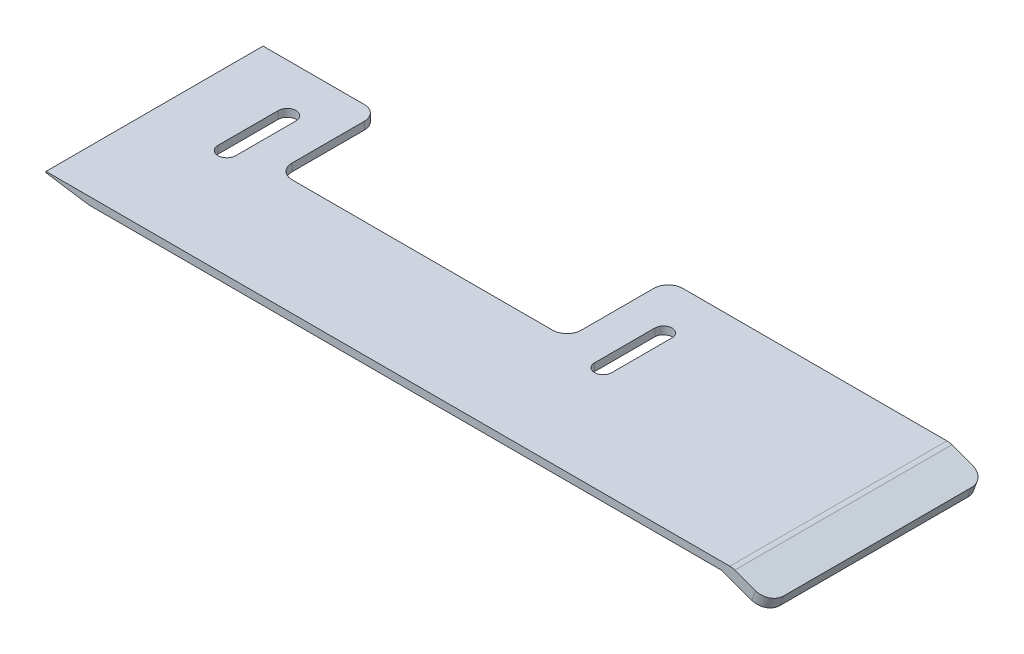
ISO-10303-21;
HEADER;
FILE_DESCRIPTION(('STEP AP214'),'2;1');
FILE_NAME('part.step','',(''),(''),'','','');
FILE_SCHEMA(('AUTOMOTIVE_DESIGN { 1 0 10303 214 1 1 1 1 }'));
ENDSEC;
DATA;
#1=APPLICATION_CONTEXT('core data for automotive mechanical design processes');
#2=APPLICATION_PROTOCOL_DEFINITION('international standard','automotive_design',2000,#1);
#3=PRODUCT_CONTEXT('',#1,'mechanical');
#4=PRODUCT('Part','Part','',(#3));
#5=PRODUCT_RELATED_PRODUCT_CATEGORY('part','',(#4));
#6=PRODUCT_DEFINITION_FORMATION('','',#4);
#7=PRODUCT_DEFINITION_CONTEXT('part definition',#1,'design');
#8=PRODUCT_DEFINITION('design','',#6,#7);
#9=PRODUCT_DEFINITION_SHAPE('','',#8);
#10=(LENGTH_UNIT() NAMED_UNIT(*) SI_UNIT(.MILLI.,.METRE.));
#11=(NAMED_UNIT(*) PLANE_ANGLE_UNIT() SI_UNIT($,.RADIAN.));
#12=(NAMED_UNIT(*) SI_UNIT($,.STERADIAN.) SOLID_ANGLE_UNIT());
#13=UNCERTAINTY_MEASURE_WITH_UNIT(LENGTH_MEASURE(1.E-05),#10,'distance_accuracy_value','');
#14=(GEOMETRIC_REPRESENTATION_CONTEXT(3) GLOBAL_UNCERTAINTY_ASSIGNED_CONTEXT((#13)) GLOBAL_UNIT_ASSIGNED_CONTEXT((#10,
#11,#12)) REPRESENTATION_CONTEXT('',''));
#15=CARTESIAN_POINT('',(0.,0.,0.));
#16=DIRECTION('',(0.,0.,1.));
#17=DIRECTION('',(1.,0.,0.));
#18=AXIS2_PLACEMENT_3D('',#15,#16,#17);
#19=CARTESIAN_POINT('',(0.,0.,0.));
#20=DIRECTION('',(0.,0.,-1.));
#21=DIRECTION('',(-1.,0.,0.));
#22=AXIS2_PLACEMENT_3D('',#19,#20,#21);
#23=PLANE('',#22);
#24=DIRECTION('',(1.,0.,0.));
#25=VECTOR('',#24,1.);
#26=CARTESIAN_POINT('',(22.4676053463481,5.16084952604156,0.));
#27=LINE('',#26,#25);
#28=CARTESIAN_POINT('',(-12.9220106473936,5.16084952604156,0.));
#29=VERTEX_POINT('',#28);
#30=CARTESIAN_POINT('',(22.4676053463481,5.16084952604156,0.));
#31=VERTEX_POINT('',#30);
#32=EDGE_CURVE('E294',#29,#31,#27,.T.);
#33=ORIENTED_EDGE('',*,*,#32,.F.);
#34=DIRECTION('',(0.,-1.,0.));
#35=VECTOR('',#34,1.);
#36=CARTESIAN_POINT('',(-12.9220106473936,6.21881141029235,0.));
#37=LINE('',#36,#35);
#38=CARTESIAN_POINT('',(-12.9220106473936,6.21881141029235,0.));
#39=VERTEX_POINT('',#38);
#40=EDGE_CURVE('E395',#29,#39,#37,.F.);
#41=ORIENTED_EDGE('',*,*,#40,.T.);
#42=DIRECTION('',(-1.,0.,0.));
#43=VECTOR('',#42,1.);
#44=CARTESIAN_POINT('',(-70.9220106473936,6.21881141029235,0.));
#45=LINE('',#44,#43);
#46=CARTESIAN_POINT('',(23.5939315975531,6.21881141029235,0.));
#47=VERTEX_POINT('',#46);
#48=EDGE_CURVE('E277',#47,#39,#45,.T.);
#49=ORIENTED_EDGE('',*,*,#48,.F.);
#50=CARTESIAN_POINT('',(23.5939315975531,4.21881141029235,0.));
#51=DIRECTION('',(0.,0.,-1.));
#52=DIRECTION('',(-1.,0.,0.));
#53=AXIS2_PLACEMENT_3D('',#50,#51,#52);
#54=CIRCLE('',#53,2.);
#55=CARTESIAN_POINT('',(24.2779718842045,6.09819665186416,0.));
#56=VERTEX_POINT('',#55);
#57=EDGE_CURVE('E345',#47,#56,#54,.T.);
#58=ORIENTED_EDGE('',*,*,#57,.T.);
#59=DIRECTION('',(-0.939692620785908,0.342020143325669,0.));
#60=VECTOR('',#59,1.);
#61=CARTESIAN_POINT('',(23.9465855589701,6.21881141029235,0.));
#62=LINE('',#61,#60);
#63=CARTESIAN_POINT('',(27.1415404696422,5.05594292298507,0.));
#64=VERTEX_POINT('',#63);
#65=EDGE_CURVE('E301',#64,#56,#62,.T.);
#66=ORIENTED_EDGE('',*,*,#65,.F.);
#67=DIRECTION('',(0.342020143325671,0.939692620785908,0.));
#68=VECTOR('',#67,1.);
#69=CARTESIAN_POINT('',(26.6285102546536,3.64640399180621,0.));
#70=LINE('',#69,#68);
#71=CARTESIAN_POINT('',(26.6285102546536,3.64640399180621,0.));
#72=VERTEX_POINT('',#71);
#73=EDGE_CURVE('E340',#64,#72,#70,.F.);
#74=ORIENTED_EDGE('',*,*,#73,.T.);
#75=DIRECTION('',(0.939692620785908,-0.34202014332567,0.));
#76=VECTOR('',#75,1.);
#77=CARTESIAN_POINT('',(28.5078954962255,2.96236370515487,0.));
#78=LINE('',#77,#76);
#79=EDGE_CURVE('E298',#31,#72,#78,.T.);
#80=ORIENTED_EDGE('',*,*,#79,.F.);
#81=EDGE_LOOP('',(#33,#41,#49,#58,#66,#74,#80));
#82=FACE_BOUND('',#81,.T.);
#83=ADVANCED_FACE('F32',(#82),#23,.T.);
#84=CARTESIAN_POINT('',(-70.9220106473936,6.06099027058349,30.));
#85=DIRECTION('',(1.,0.,0.));
#86=DIRECTION('',(0.,0.,-1.));
#87=AXIS2_PLACEMENT_3D('',#84,#85,#86);
#88=PLANE('',#87);
#89=DIRECTION('',(0.,-1.,0.));
#90=VECTOR('',#89,1.);
#91=CARTESIAN_POINT('',(-70.9220106473936,6.06099027058349,0.));
#92=LINE('',#91,#90);
#93=CARTESIAN_POINT('',(-70.9220106473936,6.21881141029235,0.));
#94=VERTEX_POINT('',#93);
#95=CARTESIAN_POINT('',(-70.9220106473936,6.06099027058349,0.));
#96=VERTEX_POINT('',#95);
#97=EDGE_CURVE('E272',#94,#96,#92,.T.);
#98=ORIENTED_EDGE('',*,*,#97,.T.);
#99=DIRECTION('',(0.,0.,-1.));
#100=VECTOR('',#99,1.);
#101=CARTESIAN_POINT('',(-70.9220106473936,6.06099027058349,30.));
#102=LINE('',#101,#100);
#103=CARTESIAN_POINT('',(-70.9220106473936,6.06099027058349,30.));
#104=VERTEX_POINT('',#103);
#105=EDGE_CURVE('E321',#104,#96,#102,.T.);
#106=ORIENTED_EDGE('',*,*,#105,.F.);
#107=DIRECTION('',(0.,-1.,0.));
#108=VECTOR('',#107,1.);
#109=CARTESIAN_POINT('',(-70.9220106473936,6.06099027058349,30.));
#110=LINE('',#109,#108);
#111=CARTESIAN_POINT('',(-70.9220106473936,6.21881141029235,30.));
#112=VERTEX_POINT('',#111);
#113=EDGE_CURVE('E273',#112,#104,#110,.T.);
#114=ORIENTED_EDGE('',*,*,#113,.F.);
#115=DIRECTION('',(0.,0.,-1.));
#116=VECTOR('',#115,1.);
#117=CARTESIAN_POINT('',(-70.9220106473936,6.21881141029235,30.));
#118=LINE('',#117,#116);
#119=EDGE_CURVE('E289',#112,#94,#118,.T.);
#120=ORIENTED_EDGE('',*,*,#119,.T.);
#121=EDGE_LOOP('',(#98,#106,#114,#120));
#122=FACE_BOUND('',#121,.T.);
#123=ADVANCED_FACE('F431',(#122),#88,.F.);
#124=CARTESIAN_POINT('',(-64.9220106473936,5.16084952604155,30.));
#125=DIRECTION('',(0.148363140244914,0.988932949505005,0.));
#126=DIRECTION('',(-0.988932949505005,0.148363140244914,0.));
#127=AXIS2_PLACEMENT_3D('',#124,#125,#126);
#128=PLANE('',#127);
#129=DIRECTION('',(0.988932949505005,-0.148363140244914,0.));
#130=VECTOR('',#129,1.);
#131=CARTESIAN_POINT('',(-64.9220106473936,5.16084952604155,0.));
#132=LINE('',#131,#130);
#133=CARTESIAN_POINT('',(-64.9220106473936,5.16084952604155,0.));
#134=VERTEX_POINT('',#133);
#135=EDGE_CURVE('E292',#96,#134,#132,.T.);
#136=ORIENTED_EDGE('',*,*,#135,.T.);
#137=DIRECTION('',(0.,0.,-1.));
#138=VECTOR('',#137,1.);
#139=CARTESIAN_POINT('',(-64.9220106473936,5.16084952604155,30.));
#140=LINE('',#139,#138);
#141=CARTESIAN_POINT('',(-64.9220106473936,5.16084952604155,30.));
#142=VERTEX_POINT('',#141);
#143=EDGE_CURVE('E318',#142,#134,#140,.T.);
#144=ORIENTED_EDGE('',*,*,#143,.F.);
#145=DIRECTION('',(0.988932949505005,-0.148363140244914,0.));
#146=VECTOR('',#145,1.);
#147=CARTESIAN_POINT('',(-64.9220106473936,5.16084952604155,30.));
#148=LINE('',#147,#146);
#149=EDGE_CURVE('E276',#104,#142,#148,.T.);
#150=ORIENTED_EDGE('',*,*,#149,.F.);
#151=ORIENTED_EDGE('',*,*,#105,.T.);
#152=EDGE_LOOP('',(#136,#144,#150,#151));
#153=FACE_BOUND('',#152,.T.);
#154=ADVANCED_FACE('F490',(#153),#128,.F.);
#155=CARTESIAN_POINT('',(22.4676053463481,5.16084952604156,30.));
#156=DIRECTION('',(0.,1.,0.));
#157=DIRECTION('',(-1.,0.,0.));
#158=AXIS2_PLACEMENT_3D('',#155,#156,#157);
#159=PLANE('',#158);
#160=DIRECTION('',(0.,0.,1.));
#161=VECTOR('',#160,1.);
#162=CARTESIAN_POINT('',(-59.6885627096651,5.16084952604156,6.67422642033291));
#163=LINE('',#162,#161);
#164=CARTESIAN_POINT('',(-59.6885627096651,5.16084952604156,6.67422642033291));
#165=VERTEX_POINT('',#164);
#166=CARTESIAN_POINT('',(-59.6885627096651,5.16084952604156,15.));
#167=VERTEX_POINT('',#166);
#168=EDGE_CURVE('E219',#165,#167,#163,.T.);
#169=ORIENTED_EDGE('',*,*,#168,.F.);
#170=CARTESIAN_POINT('',(-60.9220106473936,5.16084952604156,6.67422642033291));
#171=DIRECTION('',(0.,-1.,0.));
#172=DIRECTION('',(1.,0.,0.));
#173=AXIS2_PLACEMENT_3D('',#170,#171,#172);
#174=CIRCLE('',#173,1.23344793772846);
#175=CARTESIAN_POINT('',(-62.155458585122,5.16084952604155,6.67422642033291));
#176=VERTEX_POINT('',#175);
#177=EDGE_CURVE('E224',#176,#165,#174,.T.);
#178=ORIENTED_EDGE('',*,*,#177,.F.);
#179=DIRECTION('',(0.,0.,-1.));
#180=VECTOR('',#179,1.);
#181=CARTESIAN_POINT('',(-62.155458585122,5.16084952604155,6.67422642033291));
#182=LINE('',#181,#180);
#183=CARTESIAN_POINT('',(-62.155458585122,5.16084952604156,15.));
#184=VERTEX_POINT('',#183);
#185=EDGE_CURVE('E229',#184,#176,#182,.T.);
#186=ORIENTED_EDGE('',*,*,#185,.F.);
#187=CARTESIAN_POINT('',(-60.9220106473936,5.16084952604156,15.));
#188=DIRECTION('',(0.,-1.,0.));
#189=DIRECTION('',(1.,0.,0.));
#190=AXIS2_PLACEMENT_3D('',#187,#188,#189);
#191=CIRCLE('',#190,1.23344793772846);
#192=EDGE_CURVE('E208',#167,#184,#191,.T.);
#193=ORIENTED_EDGE('',*,*,#192,.F.);
#194=EDGE_LOOP('',(#169,#178,#186,#193));
#195=FACE_BOUND('',#194,.T.);
#196=DIRECTION('',(0.,0.,1.));
#197=VECTOR('',#196,1.);
#198=CARTESIAN_POINT('',(-7.73995637373712,5.16084952604156,6.6742264203329));
#199=LINE('',#198,#197);
#200=CARTESIAN_POINT('',(-7.73995637373713,5.16084952604156,6.67422642033291));
#201=VERTEX_POINT('',#200);
#202=CARTESIAN_POINT('',(-7.73995637373713,5.16084952604156,15.));
#203=VERTEX_POINT('',#202);
#204=EDGE_CURVE('E241',#201,#203,#199,.T.);
#205=ORIENTED_EDGE('',*,*,#204,.F.);
#206=CARTESIAN_POINT('',(-8.92201064739356,5.16084952604156,6.6742264203329));
#207=DIRECTION('',(0.,-1.,0.));
#208=DIRECTION('',(1.,0.,0.));
#209=AXIS2_PLACEMENT_3D('',#206,#207,#208);
#210=CIRCLE('',#209,1.18205427365644);
#211=CARTESIAN_POINT('',(-10.10406492105,5.16084952604156,6.6742264203329));
#212=VERTEX_POINT('',#211);
#213=EDGE_CURVE('E239',#212,#201,#210,.T.);
#214=ORIENTED_EDGE('',*,*,#213,.F.);
#215=DIRECTION('',(0.,0.,-1.));
#216=VECTOR('',#215,1.);
#217=CARTESIAN_POINT('',(-10.10406492105,5.16084952604156,6.6742264203329));
#218=LINE('',#217,#216);
#219=CARTESIAN_POINT('',(-10.10406492105,5.16084952604156,15.));
#220=VERTEX_POINT('',#219);
#221=EDGE_CURVE('E247',#220,#212,#218,.T.);
#222=ORIENTED_EDGE('',*,*,#221,.F.);
#223=CARTESIAN_POINT('',(-8.92201064739357,5.16084952604156,15.));
#224=DIRECTION('',(0.,-1.,0.));
#225=DIRECTION('',(1.,0.,0.));
#226=AXIS2_PLACEMENT_3D('',#223,#224,#225);
#227=CIRCLE('',#226,1.18205427365644);
#228=EDGE_CURVE('E244',#203,#220,#227,.T.);
#229=ORIENTED_EDGE('',*,*,#228,.F.);
#230=EDGE_LOOP('',(#205,#214,#222,#229));
#231=FACE_BOUND('',#230,.T.);
#232=CARTESIAN_POINT('',(-56.9220106473936,5.16084952604156,0.));
#233=VERTEX_POINT('',#232);
#234=EDGE_CURVE('E295',#134,#233,#27,.T.);
#235=ORIENTED_EDGE('',*,*,#234,.T.);
#236=CARTESIAN_POINT('',(-56.9220106473936,5.16084952604156,2.));
#237=DIRECTION('',(0.,1.,0.));
#238=DIRECTION('',(-1.,0.,0.));
#239=AXIS2_PLACEMENT_3D('',#236,#237,#238);
#240=CIRCLE('',#239,2.);
#241=CARTESIAN_POINT('',(-54.9220106473936,5.16084952604156,2.));
#242=VERTEX_POINT('',#241);
#243=EDGE_CURVE('E388',#233,#242,#240,.F.);
#244=ORIENTED_EDGE('',*,*,#243,.T.);
#245=DIRECTION('',(0.,0.,-1.));
#246=VECTOR('',#245,1.);
#247=CARTESIAN_POINT('',(-54.9220106473936,5.16084952604156,-2.42245212041448));
#248=LINE('',#247,#246);
#249=CARTESIAN_POINT('',(-54.9220106473936,5.16084952604156,12.));
#250=VERTEX_POINT('',#249);
#251=EDGE_CURVE('E263',#250,#242,#248,.T.);
#252=ORIENTED_EDGE('',*,*,#251,.F.);
#253=CARTESIAN_POINT('',(-52.9220106473936,5.16084952604156,12.));
#254=DIRECTION('',(0.,1.,0.));
#255=DIRECTION('',(-1.,0.,0.));
#256=AXIS2_PLACEMENT_3D('',#253,#254,#255);
#257=CIRCLE('',#256,2.);
#258=CARTESIAN_POINT('',(-52.9220106473936,5.16084952604156,14.));
#259=VERTEX_POINT('',#258);
#260=EDGE_CURVE('E40',#250,#259,#257,.T.);
#261=ORIENTED_EDGE('',*,*,#260,.T.);
#262=DIRECTION('',(-1.,0.,0.));
#263=VECTOR('',#262,1.);
#264=CARTESIAN_POINT('',(-14.9220106473936,5.16084952604156,14.));
#265=LINE('',#264,#263);
#266=CARTESIAN_POINT('',(-16.9220106473936,5.16084952604156,14.));
#267=VERTEX_POINT('',#266);
#268=EDGE_CURVE('E260',#267,#259,#265,.T.);
#269=ORIENTED_EDGE('',*,*,#268,.F.);
#270=CARTESIAN_POINT('',(-16.9220106473936,5.16084952604156,12.));
#271=DIRECTION('',(0.,1.,0.));
#272=DIRECTION('',(-1.,0.,0.));
#273=AXIS2_PLACEMENT_3D('',#270,#271,#272);
#274=CIRCLE('',#273,2.);
#275=CARTESIAN_POINT('',(-14.9220106473936,5.16084952604156,12.));
#276=VERTEX_POINT('',#275);
#277=EDGE_CURVE('E53',#267,#276,#274,.T.);
#278=ORIENTED_EDGE('',*,*,#277,.T.);
#279=DIRECTION('',(0.,0.,1.));
#280=VECTOR('',#279,1.);
#281=CARTESIAN_POINT('',(-14.9220106473936,5.16084952604156,-2.42245212041447));
#282=LINE('',#281,#280);
#283=CARTESIAN_POINT('',(-14.9220106473936,5.16084952604156,2.));
#284=VERTEX_POINT('',#283);
#285=EDGE_CURVE('E236',#284,#276,#282,.T.);
#286=ORIENTED_EDGE('',*,*,#285,.F.);
#287=CARTESIAN_POINT('',(-12.9220106473936,5.16084952604156,2.));
#288=DIRECTION('',(0.,1.,0.));
#289=DIRECTION('',(-1.,0.,0.));
#290=AXIS2_PLACEMENT_3D('',#287,#288,#289);
#291=CIRCLE('',#290,2.);
#292=EDGE_CURVE('E47',#284,#29,#291,.F.);
#293=ORIENTED_EDGE('',*,*,#292,.T.);
#294=ORIENTED_EDGE('',*,*,#32,.T.);
#295=DIRECTION('',(0.,0.,-1.));
#296=VECTOR('',#295,1.);
#297=CARTESIAN_POINT('',(22.4676053463481,5.16084952604156,30.));
#298=LINE('',#297,#296);
#299=CARTESIAN_POINT('',(22.4676053463481,5.16084952604156,30.));
#300=VERTEX_POINT('',#299);
#301=EDGE_CURVE('E315',#300,#31,#298,.T.);
#302=ORIENTED_EDGE('',*,*,#301,.F.);
#303=DIRECTION('',(1.,0.,0.));
#304=VECTOR('',#303,1.);
#305=CARTESIAN_POINT('',(22.4676053463481,5.16084952604156,30.));
#306=LINE('',#305,#304);
#307=EDGE_CURVE('E279',#142,#300,#306,.T.);
#308=ORIENTED_EDGE('',*,*,#307,.F.);
#309=ORIENTED_EDGE('',*,*,#143,.T.);
#310=EDGE_LOOP('',(#235,#244,#252,#261,#269,#278,#286,#293,#294,#302,#308,#309));
#311=FACE_BOUND('',#310,.T.);
#312=ADVANCED_FACE('F226',(#195,#231,#311),#159,.F.);
#313=CARTESIAN_POINT('',(28.5078954962255,2.96236370515487,30.));
#314=DIRECTION('',(0.34202014332567,0.939692620785908,0.));
#315=DIRECTION('',(-0.939692620785908,0.34202014332567,0.));
#316=AXIS2_PLACEMENT_3D('',#313,#314,#315);
#317=PLANE('',#316);
#318=DIRECTION('',(0.,0.,-1.));
#319=VECTOR('',#318,1.);
#320=CARTESIAN_POINT('',(28.5078954962255,2.96236370515487,30.));
#321=LINE('',#320,#319);
#322=CARTESIAN_POINT('',(28.5078954962255,2.96236370515487,28.));
#323=VERTEX_POINT('',#322);
#324=CARTESIAN_POINT('',(28.5078954962255,2.96236370515487,2.));
#325=VERTEX_POINT('',#324);
#326=EDGE_CURVE('E312',#323,#325,#321,.T.);
#327=ORIENTED_EDGE('',*,*,#326,.F.);
#328=CARTESIAN_POINT('',(26.6285102546537,3.64640399180621,28.));
#329=DIRECTION('',(0.34202014332567,0.939692620785908,0.));
#330=DIRECTION('',(-0.939692620785908,0.34202014332567,0.));
#331=AXIS2_PLACEMENT_3D('',#328,#329,#330);
#332=CIRCLE('',#331,2.);
#333=CARTESIAN_POINT('',(26.6285102546537,3.64640399180621,30.));
#334=VERTEX_POINT('',#333);
#335=EDGE_CURVE('E338',#323,#334,#332,.F.);
#336=ORIENTED_EDGE('',*,*,#335,.T.);
#337=DIRECTION('',(0.939692620785908,-0.34202014332567,0.));
#338=VECTOR('',#337,1.);
#339=CARTESIAN_POINT('',(28.5078954962255,2.96236370515487,30.));
#340=LINE('',#339,#338);
#341=EDGE_CURVE('E281',#300,#334,#340,.T.);
#342=ORIENTED_EDGE('',*,*,#341,.F.);
#343=ORIENTED_EDGE('',*,*,#301,.T.);
#344=ORIENTED_EDGE('',*,*,#79,.T.);
#345=CARTESIAN_POINT('',(26.6285102546536,3.64640399180621,2.));
#346=DIRECTION('',(0.34202014332567,0.939692620785908,0.));
#347=DIRECTION('',(-0.939692620785908,0.34202014332567,0.));
#348=AXIS2_PLACEMENT_3D('',#345,#346,#347);
#349=CIRCLE('',#348,2.);
#350=EDGE_CURVE('E336',#72,#325,#349,.F.);
#351=ORIENTED_EDGE('',*,*,#350,.T.);
#352=EDGE_LOOP('',(#327,#336,#342,#343,#344,#351));
#353=FACE_BOUND('',#352,.T.);
#354=ADVANCED_FACE('F458',(#353),#317,.F.);
#355=CARTESIAN_POINT('',(29.020925711214,4.37190263633373,30.));
#356=DIRECTION('',(-0.939692620785908,0.342020143325671,0.));
#357=DIRECTION('',(-0.342020143325671,-0.939692620785908,0.));
#358=AXIS2_PLACEMENT_3D('',#355,#356,#357);
#359=PLANE('',#358);
#360=DIRECTION('',(0.,0.,-1.));
#361=VECTOR('',#360,1.);
#362=CARTESIAN_POINT('',(29.020925711214,4.37190263633373,30.));
#363=LINE('',#362,#361);
#364=CARTESIAN_POINT('',(29.020925711214,4.37190263633373,28.));
#365=VERTEX_POINT('',#364);
#366=CARTESIAN_POINT('',(29.020925711214,4.37190263633373,2.));
#367=VERTEX_POINT('',#366);
#368=EDGE_CURVE('E309',#365,#367,#363,.T.);
#369=ORIENTED_EDGE('',*,*,#368,.F.);
#370=DIRECTION('',(0.342020143325671,0.939692620785908,0.));
#371=VECTOR('',#370,1.);
#372=CARTESIAN_POINT('',(29.020925711214,4.37190263633373,28.));
#373=LINE('',#372,#371);
#374=EDGE_CURVE('E334',#365,#323,#373,.F.);
#375=ORIENTED_EDGE('',*,*,#374,.T.);
#376=ORIENTED_EDGE('',*,*,#326,.T.);
#377=DIRECTION('',(0.342020143325671,0.939692620785908,0.));
#378=VECTOR('',#377,1.);
#379=CARTESIAN_POINT('',(29.020925711214,4.37190263633373,2.));
#380=LINE('',#379,#378);
#381=EDGE_CURVE('E331',#325,#367,#380,.T.);
#382=ORIENTED_EDGE('',*,*,#381,.T.);
#383=EDGE_LOOP('',(#369,#375,#376,#382));
#384=FACE_BOUND('',#383,.T.);
#385=ADVANCED_FACE('F453',(#384),#359,.F.);
#386=CARTESIAN_POINT('',(23.9465855589701,6.21881141029235,30.));
#387=DIRECTION('',(-0.342020143325669,-0.939692620785908,0.));
#388=DIRECTION('',(0.939692620785908,-0.342020143325669,0.));
#389=AXIS2_PLACEMENT_3D('',#386,#387,#388);
#390=PLANE('',#389);
#391=ORIENTED_EDGE('',*,*,#65,.T.);
#392=DIRECTION('',(0.,0.,-1.));
#393=VECTOR('',#392,1.);
#394=CARTESIAN_POINT('',(24.2779718842045,6.09819665186416,30.));
#395=LINE('',#394,#393);
#396=CARTESIAN_POINT('',(24.2779718842045,6.09819665186416,30.));
#397=VERTEX_POINT('',#396);
#398=EDGE_CURVE('E347',#56,#397,#395,.F.);
#399=ORIENTED_EDGE('',*,*,#398,.T.);
#400=DIRECTION('',(-0.939692620785908,0.342020143325669,0.));
#401=VECTOR('',#400,1.);
#402=CARTESIAN_POINT('',(23.9465855589701,6.21881141029235,30.));
#403=LINE('',#402,#401);
#404=CARTESIAN_POINT('',(27.1415404696422,5.05594292298507,30.));
#405=VERTEX_POINT('',#404);
#406=EDGE_CURVE('E284',#405,#397,#403,.T.);
#407=ORIENTED_EDGE('',*,*,#406,.F.);
#408=CARTESIAN_POINT('',(27.1415404696422,5.05594292298507,28.));
#409=DIRECTION('',(-0.342020143325669,-0.939692620785908,0.));
#410=DIRECTION('',(0.939692620785908,-0.342020143325669,0.));
#411=AXIS2_PLACEMENT_3D('',#408,#409,#410);
#412=CIRCLE('',#411,2.);
#413=EDGE_CURVE('E329',#405,#365,#412,.F.);
#414=ORIENTED_EDGE('',*,*,#413,.T.);
#415=ORIENTED_EDGE('',*,*,#368,.T.);
#416=CARTESIAN_POINT('',(27.1415404696422,5.05594292298507,2.));
#417=DIRECTION('',(-0.342020143325669,-0.939692620785908,0.));
#418=DIRECTION('',(0.939692620785908,-0.342020143325669,0.));
#419=AXIS2_PLACEMENT_3D('',#416,#417,#418);
#420=CIRCLE('',#419,2.);
#421=EDGE_CURVE('E327',#367,#64,#420,.F.);
#422=ORIENTED_EDGE('',*,*,#421,.T.);
#423=EDGE_LOOP('',(#391,#399,#407,#414,#415,#422));
#424=FACE_BOUND('',#423,.T.);
#425=ADVANCED_FACE('F445',(#424),#390,.F.);
#426=CARTESIAN_POINT('',(-70.9220106473936,6.21881141029235,30.));
#427=DIRECTION('',(0.,-1.,0.));
#428=DIRECTION('',(0.,0.,-1.));
#429=AXIS2_PLACEMENT_3D('',#426,#427,#428);
#430=PLANE('',#429);
#431=DIRECTION('',(0.,0.,-1.));
#432=VECTOR('',#431,1.);
#433=CARTESIAN_POINT('',(-62.155458585122,6.21881141029235,30.));
#434=LINE('',#433,#432);
#435=CARTESIAN_POINT('',(-62.155458585122,6.21881141029235,15.));
#436=VERTEX_POINT('',#435);
#437=CARTESIAN_POINT('',(-62.155458585122,6.21881141029235,6.67422642033291));
#438=VERTEX_POINT('',#437);
#439=EDGE_CURVE('E369',#436,#438,#434,.T.);
#440=ORIENTED_EDGE('',*,*,#439,.T.);
#441=CARTESIAN_POINT('',(-60.9220106473936,6.21881141029235,6.67422642033291));
#442=DIRECTION('',(0.,-1.,0.));
#443=DIRECTION('',(0.,0.,-1.));
#444=AXIS2_PLACEMENT_3D('',#441,#442,#443);
#445=CIRCLE('',#444,1.23344793772846);
#446=CARTESIAN_POINT('',(-59.6885627096651,6.21881141029235,6.67422642033291));
#447=VERTEX_POINT('',#446);
#448=EDGE_CURVE('E372',#438,#447,#445,.T.);
#449=ORIENTED_EDGE('',*,*,#448,.T.);
#450=DIRECTION('',(0.,0.,1.));
#451=VECTOR('',#450,1.);
#452=CARTESIAN_POINT('',(-59.6885627096651,6.21881141029235,30.));
#453=LINE('',#452,#451);
#454=CARTESIAN_POINT('',(-59.6885627096651,6.21881141029235,15.));
#455=VERTEX_POINT('',#454);
#456=EDGE_CURVE('E366',#447,#455,#453,.T.);
#457=ORIENTED_EDGE('',*,*,#456,.T.);
#458=CARTESIAN_POINT('',(-60.9220106473936,6.21881141029235,15.));
#459=DIRECTION('',(0.,-1.,0.));
#460=DIRECTION('',(0.,0.,-1.));
#461=AXIS2_PLACEMENT_3D('',#458,#459,#460);
#462=CIRCLE('',#461,1.23344793772846);
#463=EDGE_CURVE('E211',#455,#436,#462,.T.);
#464=ORIENTED_EDGE('',*,*,#463,.T.);
#465=EDGE_LOOP('',(#440,#449,#457,#464));
#466=FACE_BOUND('',#465,.T.);
#467=DIRECTION('',(0.,0.,-1.));
#468=VECTOR('',#467,1.);
#469=CARTESIAN_POINT('',(-10.10406492105,6.21881141029235,30.));
#470=LINE('',#469,#468);
#471=CARTESIAN_POINT('',(-10.10406492105,6.21881141029235,15.));
#472=VERTEX_POINT('',#471);
#473=CARTESIAN_POINT('',(-10.10406492105,6.21881141029235,6.6742264203329));
#474=VERTEX_POINT('',#473);
#475=EDGE_CURVE('E360',#472,#474,#470,.T.);
#476=ORIENTED_EDGE('',*,*,#475,.T.);
#477=CARTESIAN_POINT('',(-8.92201064739356,6.21881141029235,6.6742264203329));
#478=DIRECTION('',(0.,-1.,0.));
#479=DIRECTION('',(0.,0.,-1.));
#480=AXIS2_PLACEMENT_3D('',#477,#478,#479);
#481=CIRCLE('',#480,1.18205427365644);
#482=CARTESIAN_POINT('',(-7.73995637373712,6.21881141029235,6.6742264203329));
#483=VERTEX_POINT('',#482);
#484=EDGE_CURVE('E363',#474,#483,#481,.T.);
#485=ORIENTED_EDGE('',*,*,#484,.T.);
#486=DIRECTION('',(0.,0.,1.));
#487=VECTOR('',#486,1.);
#488=CARTESIAN_POINT('',(-7.73995637373714,6.21881141029235,30.));
#489=LINE('',#488,#487);
#490=CARTESIAN_POINT('',(-7.73995637373713,6.21881141029235,15.));
#491=VERTEX_POINT('',#490);
#492=EDGE_CURVE('E354',#483,#491,#489,.T.);
#493=ORIENTED_EDGE('',*,*,#492,.T.);
#494=CARTESIAN_POINT('',(-8.92201064739357,6.21881141029235,15.));
#495=DIRECTION('',(0.,-1.,0.));
#496=DIRECTION('',(0.,0.,-1.));
#497=AXIS2_PLACEMENT_3D('',#494,#495,#496);
#498=CIRCLE('',#497,1.18205427365644);
#499=EDGE_CURVE('E357',#491,#472,#498,.T.);
#500=ORIENTED_EDGE('',*,*,#499,.T.);
#501=EDGE_LOOP('',(#476,#485,#493,#500));
#502=FACE_BOUND('',#501,.T.);
#503=DIRECTION('',(0.,0.,-1.));
#504=VECTOR('',#503,1.);
#505=CARTESIAN_POINT('',(-54.9220106473936,6.21881141029235,30.));
#506=LINE('',#505,#504);
#507=CARTESIAN_POINT('',(-54.9220106473936,6.21881141029235,12.));
#508=VERTEX_POINT('',#507);
#509=CARTESIAN_POINT('',(-54.9220106473936,6.21881141029235,2.));
#510=VERTEX_POINT('',#509);
#511=EDGE_CURVE('E266',#508,#510,#506,.T.);
#512=ORIENTED_EDGE('',*,*,#511,.T.);
#513=CARTESIAN_POINT('',(-56.9220106473936,6.21881141029235,2.));
#514=DIRECTION('',(0.,-1.,0.));
#515=DIRECTION('',(0.,0.,-1.));
#516=AXIS2_PLACEMENT_3D('',#513,#514,#515);
#517=CIRCLE('',#516,2.);
#518=CARTESIAN_POINT('',(-56.9220106473936,6.21881141029235,0.));
#519=VERTEX_POINT('',#518);
#520=EDGE_CURVE('E383',#510,#519,#517,.F.);
#521=ORIENTED_EDGE('',*,*,#520,.T.);
#522=EDGE_CURVE('E304',#519,#94,#45,.T.);
#523=ORIENTED_EDGE('',*,*,#522,.T.);
#524=ORIENTED_EDGE('',*,*,#119,.F.);
#525=DIRECTION('',(-1.,0.,0.));
#526=VECTOR('',#525,1.);
#527=CARTESIAN_POINT('',(-70.9220106473936,6.21881141029235,30.));
#528=LINE('',#527,#526);
#529=CARTESIAN_POINT('',(23.5939315975531,6.21881141029235,30.));
#530=VERTEX_POINT('',#529);
#531=EDGE_CURVE('E287',#530,#112,#528,.T.);
#532=ORIENTED_EDGE('',*,*,#531,.F.);
#533=DIRECTION('',(0.,0.,-1.));
#534=VECTOR('',#533,1.);
#535=CARTESIAN_POINT('',(23.5939315975531,6.21881141029235,30.));
#536=LINE('',#535,#534);
#537=EDGE_CURVE('E342',#530,#47,#536,.T.);
#538=ORIENTED_EDGE('',*,*,#537,.T.);
#539=ORIENTED_EDGE('',*,*,#48,.T.);
#540=CARTESIAN_POINT('',(-12.9220106473936,6.21881141029235,2.));
#541=DIRECTION('',(0.,-1.,0.));
#542=DIRECTION('',(0.,0.,-1.));
#543=AXIS2_PLACEMENT_3D('',#540,#541,#542);
#544=CIRCLE('',#543,2.);
#545=CARTESIAN_POINT('',(-14.9220106473936,6.21881141029235,2.));
#546=VERTEX_POINT('',#545);
#547=EDGE_CURVE('E381',#39,#546,#544,.F.);
#548=ORIENTED_EDGE('',*,*,#547,.T.);
#549=DIRECTION('',(0.,0.,1.));
#550=VECTOR('',#549,1.);
#551=CARTESIAN_POINT('',(-14.9220106473936,6.21881141029235,30.));
#552=LINE('',#551,#550);
#553=CARTESIAN_POINT('',(-14.9220106473936,6.21881141029235,12.));
#554=VERTEX_POINT('',#553);
#555=EDGE_CURVE('E269',#546,#554,#552,.T.);
#556=ORIENTED_EDGE('',*,*,#555,.T.);
#557=CARTESIAN_POINT('',(-16.9220106473936,6.21881141029235,12.));
#558=DIRECTION('',(0.,-1.,0.));
#559=DIRECTION('',(0.,0.,-1.));
#560=AXIS2_PLACEMENT_3D('',#557,#558,#559);
#561=CIRCLE('',#560,2.);
#562=CARTESIAN_POINT('',(-16.9220106473936,6.21881141029235,14.));
#563=VERTEX_POINT('',#562);
#564=EDGE_CURVE('E403',#554,#563,#561,.T.);
#565=ORIENTED_EDGE('',*,*,#564,.T.);
#566=DIRECTION('',(-1.,0.,0.));
#567=VECTOR('',#566,1.);
#568=CARTESIAN_POINT('',(-70.9220106473936,6.21881141029235,14.));
#569=LINE('',#568,#567);
#570=CARTESIAN_POINT('',(-52.9220106473936,6.21881141029235,14.));
#571=VERTEX_POINT('',#570);
#572=EDGE_CURVE('E351',#563,#571,#569,.T.);
#573=ORIENTED_EDGE('',*,*,#572,.T.);
#574=CARTESIAN_POINT('',(-52.9220106473936,6.21881141029235,12.));
#575=DIRECTION('',(0.,-1.,0.));
#576=DIRECTION('',(0.,0.,-1.));
#577=AXIS2_PLACEMENT_3D('',#574,#575,#576);
#578=CIRCLE('',#577,2.);
#579=EDGE_CURVE('E11',#571,#508,#578,.T.);
#580=ORIENTED_EDGE('',*,*,#579,.T.);
#581=EDGE_LOOP('',(#512,#521,#523,#524,#532,#538,#539,#548,#556,#565,#573,#580));
#582=FACE_BOUND('',#581,.T.);
#583=ADVANCED_FACE('F415',(#466,#502,#582),#430,.F.);
#584=CARTESIAN_POINT('',(0.,0.,30.));
#585=DIRECTION('',(0.,0.,-1.));
#586=DIRECTION('',(-1.,0.,0.));
#587=AXIS2_PLACEMENT_3D('',#584,#585,#586);
#588=PLANE('',#587);
#589=ORIENTED_EDGE('',*,*,#406,.T.);
#590=CARTESIAN_POINT('',(23.5939315975531,4.21881141029235,30.));
#591=DIRECTION('',(0.,0.,-1.));
#592=DIRECTION('',(-1.,0.,0.));
#593=AXIS2_PLACEMENT_3D('',#590,#591,#592);
#594=CIRCLE('',#593,2.);
#595=EDGE_CURVE('E349',#397,#530,#594,.F.);
#596=ORIENTED_EDGE('',*,*,#595,.T.);
#597=ORIENTED_EDGE('',*,*,#531,.T.);
#598=ORIENTED_EDGE('',*,*,#113,.T.);
#599=ORIENTED_EDGE('',*,*,#149,.T.);
#600=ORIENTED_EDGE('',*,*,#307,.T.);
#601=ORIENTED_EDGE('',*,*,#341,.T.);
#602=DIRECTION('',(0.342020143325671,0.939692620785908,0.));
#603=VECTOR('',#602,1.);
#604=CARTESIAN_POINT('',(22.3416346289616,-8.1316899897931,30.));
#605=LINE('',#604,#603);
#606=EDGE_CURVE('E324',#334,#405,#605,.T.);
#607=ORIENTED_EDGE('',*,*,#606,.T.);
#608=EDGE_LOOP('',(#589,#596,#597,#598,#599,#600,#601,#607));
#609=FACE_BOUND('',#608,.T.);
#610=ADVANCED_FACE('F463',(#609),#588,.F.);
#611=ORIENTED_EDGE('',*,*,#522,.F.);
#612=DIRECTION('',(0.,1.,0.));
#613=VECTOR('',#612,1.);
#614=CARTESIAN_POINT('',(-56.9220106473936,5.16084952604156,0.));
#615=LINE('',#614,#613);
#616=EDGE_CURVE('E385',#519,#233,#615,.F.);
#617=ORIENTED_EDGE('',*,*,#616,.T.);
#618=ORIENTED_EDGE('',*,*,#234,.F.);
#619=ORIENTED_EDGE('',*,*,#135,.F.);
#620=ORIENTED_EDGE('',*,*,#97,.F.);
#621=EDGE_LOOP('',(#611,#617,#618,#619,#620));
#622=FACE_BOUND('',#621,.T.);
#623=ADVANCED_FACE('F427',(#622),#23,.T.);
#624=CARTESIAN_POINT('',(22.3416346289616,-8.1316899897931,28.));
#625=DIRECTION('',(0.342020143325671,0.939692620785908,0.));
#626=DIRECTION('',(-0.939692620785908,0.342020143325671,0.));
#627=AXIS2_PLACEMENT_3D('',#624,#625,#626);
#628=CYLINDRICAL_SURFACE('',#627,2.);
#629=ORIENTED_EDGE('',*,*,#335,.F.);
#630=ORIENTED_EDGE('',*,*,#374,.F.);
#631=ORIENTED_EDGE('',*,*,#413,.F.);
#632=ORIENTED_EDGE('',*,*,#606,.F.);
#633=EDGE_LOOP('',(#629,#630,#631,#632));
#634=FACE_BOUND('',#633,.T.);
#635=ADVANCED_FACE('F462',(#634),#628,.T.);
#636=CARTESIAN_POINT('',(27.1415404696422,5.05594292298507,2.));
#637=DIRECTION('',(-0.342020143325671,-0.939692620785908,0.));
#638=DIRECTION('',(0.939692620785908,-0.342020143325671,0.));
#639=AXIS2_PLACEMENT_3D('',#636,#637,#638);
#640=CYLINDRICAL_SURFACE('',#639,2.);
#641=ORIENTED_EDGE('',*,*,#350,.F.);
#642=ORIENTED_EDGE('',*,*,#73,.F.);
#643=ORIENTED_EDGE('',*,*,#421,.F.);
#644=ORIENTED_EDGE('',*,*,#381,.F.);
#645=EDGE_LOOP('',(#641,#642,#643,#644));
#646=FACE_BOUND('',#645,.T.);
#647=ADVANCED_FACE('F451',(#646),#640,.T.);
#648=CARTESIAN_POINT('',(23.5939315975531,4.21881141029235,30.));
#649=DIRECTION('',(0.,0.,-1.));
#650=DIRECTION('',(-1.,0.,0.));
#651=AXIS2_PLACEMENT_3D('',#648,#649,#650);
#652=CYLINDRICAL_SURFACE('',#651,2.);
#653=ORIENTED_EDGE('',*,*,#595,.F.);
#654=ORIENTED_EDGE('',*,*,#398,.F.);
#655=ORIENTED_EDGE('',*,*,#57,.F.);
#656=ORIENTED_EDGE('',*,*,#537,.F.);
#657=EDGE_LOOP('',(#653,#654,#655,#656));
#658=FACE_BOUND('',#657,.T.);
#659=ADVANCED_FACE('F439',(#658),#652,.T.);
#660=CARTESIAN_POINT('',(-14.9220106473936,35.1608495260416,14.));
#661=DIRECTION('',(0.,0.,1.));
#662=DIRECTION('',(1.,0.,0.));
#663=AXIS2_PLACEMENT_3D('',#660,#661,#662);
#664=PLANE('',#663);
#665=ORIENTED_EDGE('',*,*,#572,.F.);
#666=DIRECTION('',(0.,-1.,0.));
#667=VECTOR('',#666,1.);
#668=CARTESIAN_POINT('',(-16.9220106473936,5.16084952604156,14.));
#669=LINE('',#668,#667);
#670=EDGE_CURVE('E399',#563,#267,#669,.T.);
#671=ORIENTED_EDGE('',*,*,#670,.T.);
#672=ORIENTED_EDGE('',*,*,#268,.T.);
#673=DIRECTION('',(0.,-1.,0.));
#674=VECTOR('',#673,1.);
#675=CARTESIAN_POINT('',(-52.9220106473936,6.21881141029235,14.));
#676=LINE('',#675,#674);
#677=EDGE_CURVE('E397',#259,#571,#676,.F.);
#678=ORIENTED_EDGE('',*,*,#677,.T.);
#679=EDGE_LOOP('',(#665,#671,#672,#678));
#680=FACE_BOUND('',#679,.T.);
#681=ADVANCED_FACE('F410',(#680),#664,.F.);
#682=CARTESIAN_POINT('',(-14.9220106473936,35.1608495260416,-2.42245212041447));
#683=DIRECTION('',(1.,0.,0.));
#684=DIRECTION('',(0.,1.,0.));
#685=AXIS2_PLACEMENT_3D('',#682,#683,#684);
#686=PLANE('',#685);
#687=ORIENTED_EDGE('',*,*,#555,.F.);
#688=DIRECTION('',(0.,-1.,0.));
#689=VECTOR('',#688,1.);
#690=CARTESIAN_POINT('',(-14.9220106473936,5.16084952604156,2.));
#691=LINE('',#690,#689);
#692=EDGE_CURVE('E392',#546,#284,#691,.T.);
#693=ORIENTED_EDGE('',*,*,#692,.T.);
#694=ORIENTED_EDGE('',*,*,#285,.T.);
#695=DIRECTION('',(0.,-1.,0.));
#696=VECTOR('',#695,1.);
#697=CARTESIAN_POINT('',(-14.9220106473936,6.21881141029235,12.));
#698=LINE('',#697,#696);
#699=EDGE_CURVE('E390',#276,#554,#698,.F.);
#700=ORIENTED_EDGE('',*,*,#699,.T.);
#701=EDGE_LOOP('',(#687,#693,#694,#700));
#702=FACE_BOUND('',#701,.T.);
#703=ADVANCED_FACE('F475',(#702),#686,.F.);
#704=CARTESIAN_POINT('',(-54.9220106473936,35.1608495260416,-2.42245212041448));
#705=DIRECTION('',(-1.,0.,0.));
#706=DIRECTION('',(0.,-1.,0.));
#707=AXIS2_PLACEMENT_3D('',#704,#705,#706);
#708=PLANE('',#707);
#709=ORIENTED_EDGE('',*,*,#251,.T.);
#710=DIRECTION('',(0.,1.,0.));
#711=VECTOR('',#710,1.);
#712=CARTESIAN_POINT('',(-54.9220106473936,6.21881141029235,2.));
#713=LINE('',#712,#711);
#714=EDGE_CURVE('E378',#242,#510,#713,.T.);
#715=ORIENTED_EDGE('',*,*,#714,.T.);
#716=ORIENTED_EDGE('',*,*,#511,.F.);
#717=DIRECTION('',(0.,-1.,0.));
#718=VECTOR('',#717,1.);
#719=CARTESIAN_POINT('',(-54.9220106473936,5.16084952604156,12.));
#720=LINE('',#719,#718);
#721=EDGE_CURVE('E375',#508,#250,#720,.T.);
#722=ORIENTED_EDGE('',*,*,#721,.T.);
#723=EDGE_LOOP('',(#709,#715,#716,#722));
#724=FACE_BOUND('',#723,.T.);
#725=ADVANCED_FACE('F417',(#724),#708,.F.);
#726=CARTESIAN_POINT('',(-8.92201064739357,35.1608495260416,6.6742264203329));
#727=DIRECTION('',(0.,-1.,0.));
#728=DIRECTION('',(1.,0.,0.));
#729=AXIS2_PLACEMENT_3D('',#726,#727,#728);
#730=CYLINDRICAL_SURFACE('',#729,1.18205427365644);
#731=DIRECTION('',(0.,-1.,0.));
#732=VECTOR('',#731,1.);
#733=CARTESIAN_POINT('',(-10.10406492105,35.1608495260416,6.6742264203329));
#734=LINE('',#733,#732);
#735=EDGE_CURVE('E251',#474,#212,#734,.T.);
#736=ORIENTED_EDGE('',*,*,#735,.T.);
#737=ORIENTED_EDGE('',*,*,#213,.T.);
#738=DIRECTION('',(0.,-1.,0.));
#739=VECTOR('',#738,1.);
#740=CARTESIAN_POINT('',(-7.73995637373713,35.1608495260416,6.6742264203329));
#741=LINE('',#740,#739);
#742=EDGE_CURVE('E250',#483,#201,#741,.T.);
#743=ORIENTED_EDGE('',*,*,#742,.F.);
#744=ORIENTED_EDGE('',*,*,#484,.F.);
#745=EDGE_LOOP('',(#736,#737,#743,#744));
#746=FACE_BOUND('',#745,.T.);
#747=ADVANCED_FACE('F511',(#746),#730,.F.);
#748=CARTESIAN_POINT('',(-10.10406492105,35.1608495260416,6.6742264203329));
#749=DIRECTION('',(-1.,0.,0.));
#750=DIRECTION('',(0.,0.,1.));
#751=AXIS2_PLACEMENT_3D('',#748,#749,#750);
#752=PLANE('',#751);
#753=DIRECTION('',(0.,-1.,0.));
#754=VECTOR('',#753,1.);
#755=CARTESIAN_POINT('',(-10.10406492105,35.1608495260416,15.));
#756=LINE('',#755,#754);
#757=EDGE_CURVE('E253',#472,#220,#756,.T.);
#758=ORIENTED_EDGE('',*,*,#757,.T.);
#759=ORIENTED_EDGE('',*,*,#221,.T.);
#760=ORIENTED_EDGE('',*,*,#735,.F.);
#761=ORIENTED_EDGE('',*,*,#475,.F.);
#762=EDGE_LOOP('',(#758,#759,#760,#761));
#763=FACE_BOUND('',#762,.T.);
#764=ADVANCED_FACE('F514',(#763),#752,.F.);
#765=CARTESIAN_POINT('',(-8.92201064739357,35.1608495260416,15.));
#766=DIRECTION('',(0.,-1.,0.));
#767=DIRECTION('',(1.,0.,0.));
#768=AXIS2_PLACEMENT_3D('',#765,#766,#767);
#769=CYLINDRICAL_SURFACE('',#768,1.18205427365644);
#770=DIRECTION('',(0.,-1.,0.));
#771=VECTOR('',#770,1.);
#772=CARTESIAN_POINT('',(-7.73995637373713,35.1608495260416,15.));
#773=LINE('',#772,#771);
#774=EDGE_CURVE('E255',#491,#203,#773,.T.);
#775=ORIENTED_EDGE('',*,*,#774,.T.);
#776=ORIENTED_EDGE('',*,*,#228,.T.);
#777=ORIENTED_EDGE('',*,*,#757,.F.);
#778=ORIENTED_EDGE('',*,*,#499,.F.);
#779=EDGE_LOOP('',(#775,#776,#777,#778));
#780=FACE_BOUND('',#779,.T.);
#781=ADVANCED_FACE('F520',(#780),#769,.F.);
#782=CARTESIAN_POINT('',(-7.73995637373713,35.1608495260416,6.6742264203329));
#783=DIRECTION('',(1.,0.,0.));
#784=DIRECTION('',(0.,0.,-1.));
#785=AXIS2_PLACEMENT_3D('',#782,#783,#784);
#786=PLANE('',#785);
#787=ORIENTED_EDGE('',*,*,#742,.T.);
#788=ORIENTED_EDGE('',*,*,#204,.T.);
#789=ORIENTED_EDGE('',*,*,#774,.F.);
#790=ORIENTED_EDGE('',*,*,#492,.F.);
#791=EDGE_LOOP('',(#787,#788,#789,#790));
#792=FACE_BOUND('',#791,.T.);
#793=ADVANCED_FACE('F516',(#792),#786,.F.);
#794=CARTESIAN_POINT('',(-60.9220106473936,35.1608495260416,6.67422642033291));
#795=DIRECTION('',(0.,-1.,0.));
#796=DIRECTION('',(1.,0.,0.));
#797=AXIS2_PLACEMENT_3D('',#794,#795,#796);
#798=CYLINDRICAL_SURFACE('',#797,1.23344793772846);
#799=DIRECTION('',(0.,-1.,0.));
#800=VECTOR('',#799,1.);
#801=CARTESIAN_POINT('',(-62.155458585122,35.1608495260416,6.67422642033291));
#802=LINE('',#801,#800);
#803=EDGE_CURVE('E234',#438,#176,#802,.T.);
#804=ORIENTED_EDGE('',*,*,#803,.T.);
#805=ORIENTED_EDGE('',*,*,#177,.T.);
#806=DIRECTION('',(0.,-1.,0.));
#807=VECTOR('',#806,1.);
#808=CARTESIAN_POINT('',(-59.6885627096651,35.1608495260416,6.67422642033291));
#809=LINE('',#808,#807);
#810=EDGE_CURVE('E215',#447,#165,#809,.T.);
#811=ORIENTED_EDGE('',*,*,#810,.F.);
#812=ORIENTED_EDGE('',*,*,#448,.F.);
#813=EDGE_LOOP('',(#804,#805,#811,#812));
#814=FACE_BOUND('',#813,.T.);
#815=ADVANCED_FACE('F519',(#814),#798,.F.);
#816=CARTESIAN_POINT('',(-62.155458585122,35.1608495260416,6.67422642033291));
#817=DIRECTION('',(-1.,0.,0.));
#818=DIRECTION('',(0.,-1.,0.));
#819=AXIS2_PLACEMENT_3D('',#816,#817,#818);
#820=PLANE('',#819);
#821=DIRECTION('',(0.,-1.,0.));
#822=VECTOR('',#821,1.);
#823=CARTESIAN_POINT('',(-62.155458585122,35.1608495260416,15.));
#824=LINE('',#823,#822);
#825=EDGE_CURVE('E214',#436,#184,#824,.T.);
#826=ORIENTED_EDGE('',*,*,#825,.T.);
#827=ORIENTED_EDGE('',*,*,#185,.T.);
#828=ORIENTED_EDGE('',*,*,#803,.F.);
#829=ORIENTED_EDGE('',*,*,#439,.F.);
#830=EDGE_LOOP('',(#826,#827,#828,#829));
#831=FACE_BOUND('',#830,.T.);
#832=ADVANCED_FACE('F530',(#831),#820,.F.);
#833=CARTESIAN_POINT('',(-60.9220106473936,35.1608495260416,15.));
#834=DIRECTION('',(0.,-1.,0.));
#835=DIRECTION('',(1.,0.,0.));
#836=AXIS2_PLACEMENT_3D('',#833,#834,#835);
#837=CYLINDRICAL_SURFACE('',#836,1.23344793772846);
#838=DIRECTION('',(0.,-1.,0.));
#839=VECTOR('',#838,1.);
#840=CARTESIAN_POINT('',(-59.6885627096651,35.1608495260416,15.));
#841=LINE('',#840,#839);
#842=EDGE_CURVE('E203',#455,#167,#841,.T.);
#843=ORIENTED_EDGE('',*,*,#842,.T.);
#844=ORIENTED_EDGE('',*,*,#192,.T.);
#845=ORIENTED_EDGE('',*,*,#825,.F.);
#846=ORIENTED_EDGE('',*,*,#463,.F.);
#847=EDGE_LOOP('',(#843,#844,#845,#846));
#848=FACE_BOUND('',#847,.T.);
#849=ADVANCED_FACE('F205',(#848),#837,.F.);
#850=CARTESIAN_POINT('',(-59.6885627096651,35.1608495260416,6.67422642033291));
#851=DIRECTION('',(1.,0.,0.));
#852=DIRECTION('',(0.,0.,-1.));
#853=AXIS2_PLACEMENT_3D('',#850,#851,#852);
#854=PLANE('',#853);
#855=ORIENTED_EDGE('',*,*,#810,.T.);
#856=ORIENTED_EDGE('',*,*,#168,.T.);
#857=ORIENTED_EDGE('',*,*,#842,.F.);
#858=ORIENTED_EDGE('',*,*,#456,.F.);
#859=EDGE_LOOP('',(#855,#856,#857,#858));
#860=FACE_BOUND('',#859,.T.);
#861=ADVANCED_FACE('F220',(#860),#854,.F.);
#862=CARTESIAN_POINT('',(-56.9220106473936,35.1608495260416,2.));
#863=DIRECTION('',(0.,-1.,0.));
#864=DIRECTION('',(1.,0.,0.));
#865=AXIS2_PLACEMENT_3D('',#862,#863,#864);
#866=CYLINDRICAL_SURFACE('',#865,2.);
#867=ORIENTED_EDGE('',*,*,#243,.F.);
#868=ORIENTED_EDGE('',*,*,#616,.F.);
#869=ORIENTED_EDGE('',*,*,#520,.F.);
#870=ORIENTED_EDGE('',*,*,#714,.F.);
#871=EDGE_LOOP('',(#867,#868,#869,#870));
#872=FACE_BOUND('',#871,.T.);
#873=ADVANCED_FACE('F421',(#872),#866,.T.);
#874=CARTESIAN_POINT('',(-12.9220106473936,35.1608495260416,2.));
#875=DIRECTION('',(0.,1.,0.));
#876=DIRECTION('',(-1.,0.,0.));
#877=AXIS2_PLACEMENT_3D('',#874,#875,#876);
#878=CYLINDRICAL_SURFACE('',#877,2.);
#879=ORIENTED_EDGE('',*,*,#547,.F.);
#880=ORIENTED_EDGE('',*,*,#40,.F.);
#881=ORIENTED_EDGE('',*,*,#292,.F.);
#882=ORIENTED_EDGE('',*,*,#692,.F.);
#883=EDGE_LOOP('',(#879,#880,#881,#882));
#884=FACE_BOUND('',#883,.T.);
#885=ADVANCED_FACE('F470',(#884),#878,.T.);
#886=CARTESIAN_POINT('',(-16.9220106473936,35.1608495260416,12.));
#887=DIRECTION('',(0.,1.,0.));
#888=DIRECTION('',(-1.,0.,0.));
#889=AXIS2_PLACEMENT_3D('',#886,#887,#888);
#890=CYLINDRICAL_SURFACE('',#889,2.);
#891=ORIENTED_EDGE('',*,*,#564,.F.);
#892=ORIENTED_EDGE('',*,*,#699,.F.);
#893=ORIENTED_EDGE('',*,*,#277,.F.);
#894=ORIENTED_EDGE('',*,*,#670,.F.);
#895=EDGE_LOOP('',(#891,#892,#893,#894));
#896=FACE_BOUND('',#895,.T.);
#897=ADVANCED_FACE('F478',(#896),#890,.F.);
#898=CARTESIAN_POINT('',(-52.9220106473936,35.1608495260416,12.));
#899=DIRECTION('',(0.,1.,0.));
#900=DIRECTION('',(-1.,0.,0.));
#901=AXIS2_PLACEMENT_3D('',#898,#899,#900);
#902=CYLINDRICAL_SURFACE('',#901,2.);
#903=ORIENTED_EDGE('',*,*,#579,.F.);
#904=ORIENTED_EDGE('',*,*,#677,.F.);
#905=ORIENTED_EDGE('',*,*,#260,.F.);
#906=ORIENTED_EDGE('',*,*,#721,.F.);
#907=EDGE_LOOP('',(#903,#904,#905,#906));
#908=FACE_BOUND('',#907,.T.);
#909=ADVANCED_FACE('F34',(#908),#902,.F.);
#910=CLOSED_SHELL('',(#83,#123,#154,#312,#354,#385,#425,#583,#610,#623,#635,#647,#659,#681,#703,
#725,#747,#764,#781,#793,#815,#832,#849,#861,#873,#885,#897,#909));
#911=MANIFOLD_SOLID_BREP('B2',#910);
#912=ADVANCED_BREP_SHAPE_REPRESENTATION('',(#18,#911),#14);
#913=SHAPE_DEFINITION_REPRESENTATION(#9,#912);
ENDSEC;
END-ISO-10303-21;
